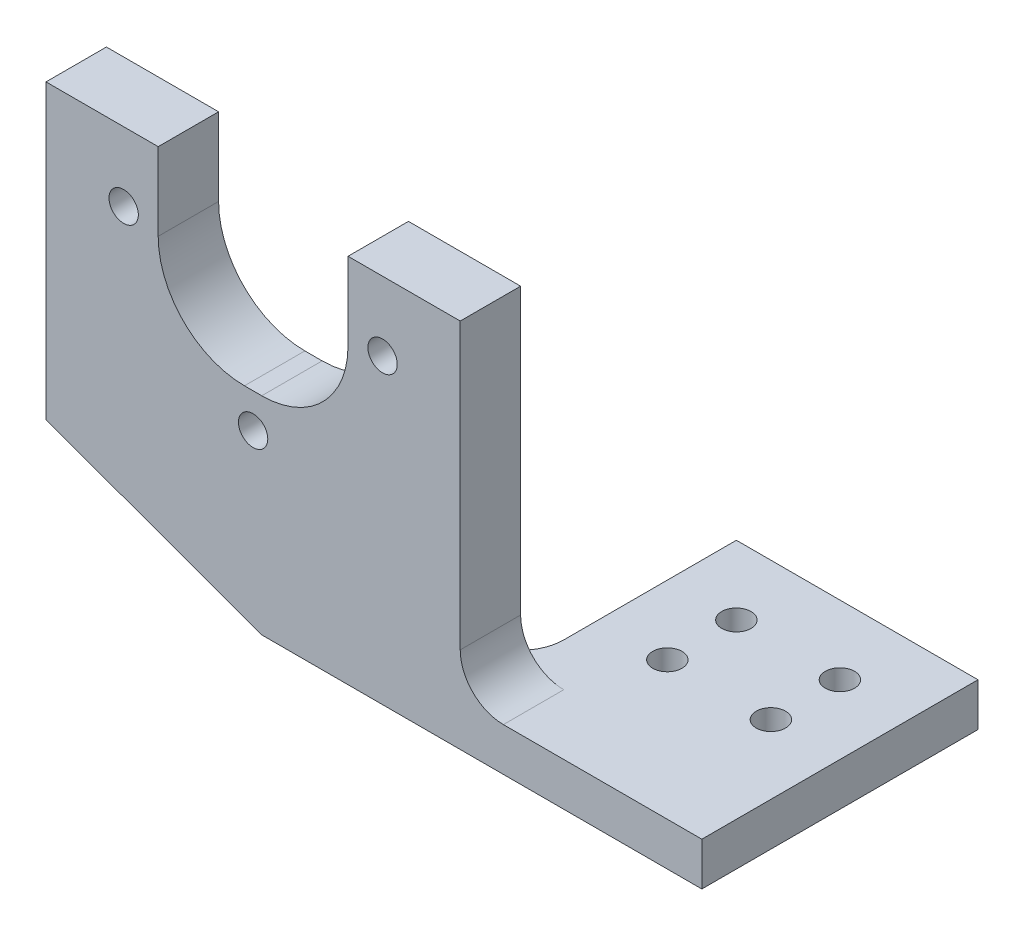
ISO-10303-21;
HEADER;
FILE_DESCRIPTION(('STEP AP214'),'2;1');
FILE_NAME('part.step','',(''),(''),'','','');
FILE_SCHEMA(('AUTOMOTIVE_DESIGN { 1 0 10303 214 1 1 1 1 }'));
ENDSEC;
DATA;
#1=APPLICATION_CONTEXT('core data for automotive mechanical design processes');
#2=APPLICATION_PROTOCOL_DEFINITION('international standard','automotive_design',2000,#1);
#3=PRODUCT_CONTEXT('',#1,'mechanical');
#4=PRODUCT('Part','Part','',(#3));
#5=PRODUCT_RELATED_PRODUCT_CATEGORY('part','',(#4));
#6=PRODUCT_DEFINITION_FORMATION('','',#4);
#7=PRODUCT_DEFINITION_CONTEXT('part definition',#1,'design');
#8=PRODUCT_DEFINITION('design','',#6,#7);
#9=PRODUCT_DEFINITION_SHAPE('','',#8);
#10=(LENGTH_UNIT() NAMED_UNIT(*) SI_UNIT(.MILLI.,.METRE.));
#11=(NAMED_UNIT(*) PLANE_ANGLE_UNIT() SI_UNIT($,.RADIAN.));
#12=(NAMED_UNIT(*) SI_UNIT($,.STERADIAN.) SOLID_ANGLE_UNIT());
#13=UNCERTAINTY_MEASURE_WITH_UNIT(LENGTH_MEASURE(1.E-05),#10,'distance_accuracy_value','');
#14=(GEOMETRIC_REPRESENTATION_CONTEXT(3) GLOBAL_UNCERTAINTY_ASSIGNED_CONTEXT((#13)) GLOBAL_UNIT_ASSIGNED_CONTEXT((#10,
#11,#12)) REPRESENTATION_CONTEXT('',''));
#15=CARTESIAN_POINT('',(0.,0.,0.));
#16=DIRECTION('',(0.,0.,1.));
#17=DIRECTION('',(1.,0.,0.));
#18=AXIS2_PLACEMENT_3D('',#15,#16,#17);
#19=CARTESIAN_POINT('',(14.,5.,16.));
#20=DIRECTION('',(-1.,0.,0.));
#21=DIRECTION('',(0.,0.,1.));
#22=AXIS2_PLACEMENT_3D('',#19,#20,#21);
#23=PLANE('',#22);
#24=DIRECTION('',(0.,0.,-1.));
#25=VECTOR('',#24,1.);
#26=CARTESIAN_POINT('',(14.,0.,16.));
#27=LINE('',#26,#25);
#28=CARTESIAN_POINT('',(14.,0.,16.));
#29=VERTEX_POINT('',#28);
#30=CARTESIAN_POINT('',(14.,0.,-16.));
#31=VERTEX_POINT('',#30);
#32=EDGE_CURVE('E241',#29,#31,#27,.T.);
#33=ORIENTED_EDGE('',*,*,#32,.T.);
#34=DIRECTION('',(0.,-1.,0.));
#35=VECTOR('',#34,1.);
#36=CARTESIAN_POINT('',(14.,5.,-16.));
#37=LINE('',#36,#35);
#38=CARTESIAN_POINT('',(14.,5.,-16.));
#39=VERTEX_POINT('',#38);
#40=EDGE_CURVE('E267',#39,#31,#37,.T.);
#41=ORIENTED_EDGE('',*,*,#40,.F.);
#42=DIRECTION('',(0.,0.,-1.));
#43=VECTOR('',#42,1.);
#44=CARTESIAN_POINT('',(14.,5.,16.));
#45=LINE('',#44,#43);
#46=CARTESIAN_POINT('',(14.,5.,16.));
#47=VERTEX_POINT('',#46);
#48=EDGE_CURVE('E242',#47,#39,#45,.T.);
#49=ORIENTED_EDGE('',*,*,#48,.F.);
#50=DIRECTION('',(0.,-1.,0.));
#51=VECTOR('',#50,1.);
#52=CARTESIAN_POINT('',(14.,5.,16.));
#53=LINE('',#52,#51);
#54=EDGE_CURVE('E253',#47,#29,#53,.T.);
#55=ORIENTED_EDGE('',*,*,#54,.T.);
#56=EDGE_LOOP('',(#33,#41,#49,#55));
#57=FACE_BOUND('',#56,.T.);
#58=ADVANCED_FACE('F36',(#57),#23,.F.);
#59=CARTESIAN_POINT('',(-14.,5.,-16.));
#60=DIRECTION('',(0.,0.,1.));
#61=DIRECTION('',(1.,0.,0.));
#62=AXIS2_PLACEMENT_3D('',#59,#60,#61);
#63=PLANE('',#62);
#64=DIRECTION('',(-1.,0.,0.));
#65=VECTOR('',#64,1.);
#66=CARTESIAN_POINT('',(-14.,0.,-16.));
#67=LINE('',#66,#65);
#68=CARTESIAN_POINT('',(-14.,0.,-16.));
#69=VERTEX_POINT('',#68);
#70=EDGE_CURVE('E256',#31,#69,#67,.T.);
#71=ORIENTED_EDGE('',*,*,#70,.T.);
#72=DIRECTION('',(0.,-1.,0.));
#73=VECTOR('',#72,1.);
#74=CARTESIAN_POINT('',(-14.,5.,-16.));
#75=LINE('',#74,#73);
#76=CARTESIAN_POINT('',(-14.,5.,-16.));
#77=VERTEX_POINT('',#76);
#78=EDGE_CURVE('E264',#77,#69,#75,.T.);
#79=ORIENTED_EDGE('',*,*,#78,.F.);
#80=DIRECTION('',(-1.,0.,0.));
#81=VECTOR('',#80,1.);
#82=CARTESIAN_POINT('',(-14.,5.,-16.));
#83=LINE('',#82,#81);
#84=EDGE_CURVE('E245',#39,#77,#83,.T.);
#85=ORIENTED_EDGE('',*,*,#84,.F.);
#86=ORIENTED_EDGE('',*,*,#40,.T.);
#87=EDGE_LOOP('',(#71,#79,#85,#86));
#88=FACE_BOUND('',#87,.T.);
#89=ADVANCED_FACE('F345',(#88),#63,.F.);
#90=CARTESIAN_POINT('',(-14.,5.,16.));
#91=DIRECTION('',(1.,0.,0.));
#92=DIRECTION('',(0.,0.,-1.));
#93=AXIS2_PLACEMENT_3D('',#90,#91,#92);
#94=PLANE('',#93);
#95=DIRECTION('',(0.,0.,1.));
#96=VECTOR('',#95,1.);
#97=CARTESIAN_POINT('',(-14.,0.,16.));
#98=LINE('',#97,#96);
#99=CARTESIAN_POINT('',(-14.,0.,4.));
#100=VERTEX_POINT('',#99);
#101=EDGE_CURVE('E258',#69,#100,#98,.T.);
#102=ORIENTED_EDGE('',*,*,#101,.T.);
#103=DIRECTION('',(0.,1.,0.));
#104=VECTOR('',#103,1.);
#105=CARTESIAN_POINT('',(-14.,5.,4.));
#106=LINE('',#105,#104);
#107=CARTESIAN_POINT('',(-14.,5.,4.));
#108=VERTEX_POINT('',#107);
#109=EDGE_CURVE('E299',#100,#108,#106,.T.);
#110=ORIENTED_EDGE('',*,*,#109,.T.);
#111=DIRECTION('',(0.,0.,1.));
#112=VECTOR('',#111,1.);
#113=CARTESIAN_POINT('',(-14.,5.,16.));
#114=LINE('',#113,#112);
#115=EDGE_CURVE('E248',#77,#108,#114,.T.);
#116=ORIENTED_EDGE('',*,*,#115,.F.);
#117=ORIENTED_EDGE('',*,*,#78,.T.);
#118=EDGE_LOOP('',(#102,#110,#116,#117));
#119=FACE_BOUND('',#118,.T.);
#120=ADVANCED_FACE('F351',(#119),#94,.F.);
#121=CARTESIAN_POINT('',(-14.,5.,16.));
#122=DIRECTION('',(0.,0.,-1.));
#123=DIRECTION('',(-1.,0.,0.));
#124=AXIS2_PLACEMENT_3D('',#121,#122,#123);
#125=PLANE('',#124);
#126=CARTESIAN_POINT('',(-53.,35.,16.));
#127=DIRECTION('',(0.,0.,1.));
#128=DIRECTION('',(1.,0.,0.));
#129=AXIS2_PLACEMENT_3D('',#126,#127,#128);
#130=CIRCLE('',#129,1.7);
#131=CARTESIAN_POINT('',(-51.3,35.,16.));
#132=VERTEX_POINT('',#131);
#133=EDGE_CURVE('E318',#132,#132,#130,.T.);
#134=ORIENTED_EDGE('',*,*,#133,.F.);
#135=EDGE_LOOP('',(#134));
#136=FACE_BOUND('',#135,.T.);
#137=CARTESIAN_POINT('',(-23.,35.,16.));
#138=DIRECTION('',(0.,0.,1.));
#139=DIRECTION('',(1.,0.,0.));
#140=AXIS2_PLACEMENT_3D('',#137,#138,#139);
#141=CIRCLE('',#140,1.7);
#142=CARTESIAN_POINT('',(-21.3,35.,16.));
#143=VERTEX_POINT('',#142);
#144=EDGE_CURVE('E317',#143,#143,#141,.T.);
#145=ORIENTED_EDGE('',*,*,#144,.F.);
#146=EDGE_LOOP('',(#145));
#147=FACE_BOUND('',#146,.T.);
#148=CARTESIAN_POINT('',(-38.,20.,16.));
#149=DIRECTION('',(0.,0.,1.));
#150=DIRECTION('',(1.,0.,0.));
#151=AXIS2_PLACEMENT_3D('',#148,#149,#150);
#152=CIRCLE('',#151,1.7);
#153=CARTESIAN_POINT('',(-36.3,20.,16.));
#154=VERTEX_POINT('',#153);
#155=EDGE_CURVE('E313',#154,#154,#152,.T.);
#156=ORIENTED_EDGE('',*,*,#155,.F.);
#157=EDGE_LOOP('',(#156));
#158=FACE_BOUND('',#157,.T.);
#159=DIRECTION('',(0.,-1.,0.));
#160=VECTOR('',#159,1.);
#161=CARTESIAN_POINT('',(-62.,0.,16.));
#162=LINE('',#161,#160);
#163=CARTESIAN_POINT('',(-62.,43.,16.));
#164=VERTEX_POINT('',#163);
#165=CARTESIAN_POINT('',(-62.,9.09925585665506,16.));
#166=VERTEX_POINT('',#165);
#167=EDGE_CURVE('E165',#164,#166,#162,.T.);
#168=ORIENTED_EDGE('',*,*,#167,.T.);
#169=DIRECTION('',(-0.93969262078591,0.342020143325666,0.));
#170=VECTOR('',#169,1.);
#171=CARTESIAN_POINT('',(-62.,9.09925585665506,16.));
#172=LINE('',#171,#170);
#173=CARTESIAN_POINT('',(-36.9999999999998,0.,16.));
#174=VERTEX_POINT('',#173);
#175=EDGE_CURVE('E58',#166,#174,#172,.F.);
#176=ORIENTED_EDGE('',*,*,#175,.T.);
#177=DIRECTION('',(1.,0.,0.));
#178=VECTOR('',#177,1.);
#179=CARTESIAN_POINT('',(-14.,0.,16.));
#180=LINE('',#179,#178);
#181=EDGE_CURVE('E246',#174,#29,#180,.T.);
#182=ORIENTED_EDGE('',*,*,#181,.T.);
#183=ORIENTED_EDGE('',*,*,#54,.F.);
#184=DIRECTION('',(1.,0.,0.));
#185=VECTOR('',#184,1.);
#186=CARTESIAN_POINT('',(-14.,5.,16.));
#187=LINE('',#186,#185);
#188=CARTESIAN_POINT('',(-9.,5.,16.));
#189=VERTEX_POINT('',#188);
#190=EDGE_CURVE('E251',#189,#47,#187,.T.);
#191=ORIENTED_EDGE('',*,*,#190,.F.);
#192=CARTESIAN_POINT('',(-9.,10.,16.));
#193=DIRECTION('',(0.,0.,-1.));
#194=DIRECTION('',(-1.,0.,0.));
#195=AXIS2_PLACEMENT_3D('',#192,#193,#194);
#196=CIRCLE('',#195,5.);
#197=CARTESIAN_POINT('',(-14.,10.,16.));
#198=VERTEX_POINT('',#197);
#199=EDGE_CURVE('E295',#189,#198,#196,.T.);
#200=ORIENTED_EDGE('',*,*,#199,.T.);
#201=DIRECTION('',(0.,1.,0.));
#202=VECTOR('',#201,1.);
#203=CARTESIAN_POINT('',(-14.,43.,16.));
#204=LINE('',#203,#202);
#205=CARTESIAN_POINT('',(-14.,43.,16.));
#206=VERTEX_POINT('',#205);
#207=EDGE_CURVE('E195',#198,#206,#204,.T.);
#208=ORIENTED_EDGE('',*,*,#207,.T.);
#209=DIRECTION('',(-1.,0.,0.));
#210=VECTOR('',#209,1.);
#211=CARTESIAN_POINT('',(-27.,43.,16.));
#212=LINE('',#211,#210);
#213=CARTESIAN_POINT('',(-27.,43.,16.));
#214=VERTEX_POINT('',#213);
#215=EDGE_CURVE('E171',#206,#214,#212,.T.);
#216=ORIENTED_EDGE('',*,*,#215,.T.);
#217=DIRECTION('',(0.,-1.,0.));
#218=VECTOR('',#217,1.);
#219=CARTESIAN_POINT('',(-27.,24.,16.));
#220=LINE('',#219,#218);
#221=CARTESIAN_POINT('',(-27.,34.,16.));
#222=VERTEX_POINT('',#221);
#223=EDGE_CURVE('E199',#214,#222,#220,.T.);
#224=ORIENTED_EDGE('',*,*,#223,.T.);
#225=CARTESIAN_POINT('',(-37.,34.,16.));
#226=DIRECTION('',(0.,0.,-1.));
#227=DIRECTION('',(-1.,0.,0.));
#228=AXIS2_PLACEMENT_3D('',#225,#226,#227);
#229=CIRCLE('',#228,10.);
#230=CARTESIAN_POINT('',(-37.,24.,16.));
#231=VERTEX_POINT('',#230);
#232=EDGE_CURVE('E280',#222,#231,#229,.T.);
#233=ORIENTED_EDGE('',*,*,#232,.T.);
#234=DIRECTION('',(-1.,0.,0.));
#235=VECTOR('',#234,1.);
#236=CARTESIAN_POINT('',(-49.,24.,16.));
#237=LINE('',#236,#235);
#238=CARTESIAN_POINT('',(-39.,24.,16.));
#239=VERTEX_POINT('',#238);
#240=EDGE_CURVE('E202',#231,#239,#237,.T.);
#241=ORIENTED_EDGE('',*,*,#240,.T.);
#242=CARTESIAN_POINT('',(-39.,34.,16.));
#243=DIRECTION('',(0.,0.,-1.));
#244=DIRECTION('',(-1.,0.,0.));
#245=AXIS2_PLACEMENT_3D('',#242,#243,#244);
#246=CIRCLE('',#245,10.);
#247=CARTESIAN_POINT('',(-49.,34.,16.));
#248=VERTEX_POINT('',#247);
#249=EDGE_CURVE('E284',#239,#248,#246,.T.);
#250=ORIENTED_EDGE('',*,*,#249,.T.);
#251=DIRECTION('',(0.,1.,0.));
#252=VECTOR('',#251,1.);
#253=CARTESIAN_POINT('',(-49.,43.,16.));
#254=LINE('',#253,#252);
#255=CARTESIAN_POINT('',(-49.,43.,16.));
#256=VERTEX_POINT('',#255);
#257=EDGE_CURVE('E205',#248,#256,#254,.T.);
#258=ORIENTED_EDGE('',*,*,#257,.T.);
#259=DIRECTION('',(-1.,0.,0.));
#260=VECTOR('',#259,1.);
#261=CARTESIAN_POINT('',(-62.,43.,16.));
#262=LINE('',#261,#260);
#263=EDGE_CURVE('E207',#256,#164,#262,.T.);
#264=ORIENTED_EDGE('',*,*,#263,.T.);
#265=EDGE_LOOP('',(#168,#176,#182,#183,#191,#200,#208,#216,#224,#233,#241,#250,#258,#264));
#266=FACE_BOUND('',#265,.T.);
#267=ADVANCED_FACE('F328',(#136,#147,#158,#266),#125,.F.);
#268=CARTESIAN_POINT('',(0.,5.,0.));
#269=DIRECTION('',(0.,-1.,0.));
#270=DIRECTION('',(0.,0.,-1.));
#271=AXIS2_PLACEMENT_3D('',#268,#269,#270);
#272=PLANE('',#271);
#273=CARTESIAN_POINT('',(-6.,5.,-8.));
#274=DIRECTION('',(0.,1.,0.));
#275=DIRECTION('',(0.,0.,1.));
#276=AXIS2_PLACEMENT_3D('',#273,#274,#275);
#277=CIRCLE('',#276,1.69999999999999);
#278=CARTESIAN_POINT('',(-6.,5.,-6.30000000000001));
#279=VERTEX_POINT('',#278);
#280=EDGE_CURVE('E213',#279,#279,#277,.T.);
#281=ORIENTED_EDGE('',*,*,#280,.F.);
#282=EDGE_LOOP('',(#281));
#283=FACE_BOUND('',#282,.T.);
#284=CARTESIAN_POINT('',(6.,5.,-8.));
#285=DIRECTION('',(0.,1.,0.));
#286=DIRECTION('',(0.,0.,1.));
#287=AXIS2_PLACEMENT_3D('',#284,#285,#286);
#288=CIRCLE('',#287,1.69999999999999);
#289=CARTESIAN_POINT('',(6.,5.,-6.30000000000001));
#290=VERTEX_POINT('',#289);
#291=EDGE_CURVE('E223',#290,#290,#288,.T.);
#292=ORIENTED_EDGE('',*,*,#291,.F.);
#293=EDGE_LOOP('',(#292));
#294=FACE_BOUND('',#293,.T.);
#295=CARTESIAN_POINT('',(6.,5.,0.));
#296=DIRECTION('',(0.,1.,0.));
#297=DIRECTION('',(0.,0.,1.));
#298=AXIS2_PLACEMENT_3D('',#295,#296,#297);
#299=CIRCLE('',#298,1.69999999999999);
#300=CARTESIAN_POINT('',(6.,5.,1.69999999999999));
#301=VERTEX_POINT('',#300);
#302=EDGE_CURVE('E229',#301,#301,#299,.T.);
#303=ORIENTED_EDGE('',*,*,#302,.F.);
#304=EDGE_LOOP('',(#303));
#305=FACE_BOUND('',#304,.T.);
#306=CARTESIAN_POINT('',(-6.,5.,0.));
#307=DIRECTION('',(0.,1.,0.));
#308=DIRECTION('',(0.,0.,1.));
#309=AXIS2_PLACEMENT_3D('',#306,#307,#308);
#310=CIRCLE('',#309,1.69999999999999);
#311=CARTESIAN_POINT('',(-6.,5.,1.69999999999999));
#312=VERTEX_POINT('',#311);
#313=EDGE_CURVE('E235',#312,#312,#310,.T.);
#314=ORIENTED_EDGE('',*,*,#313,.F.);
#315=EDGE_LOOP('',(#314));
#316=FACE_BOUND('',#315,.T.);
#317=DIRECTION('',(1.,0.,0.));
#318=VECTOR('',#317,1.);
#319=CARTESIAN_POINT('',(0.,5.,9.));
#320=LINE('',#319,#318);
#321=CARTESIAN_POINT('',(-19.,5.,9.));
#322=VERTEX_POINT('',#321);
#323=CARTESIAN_POINT('',(-9.,5.,9.));
#324=VERTEX_POINT('',#323);
#325=EDGE_CURVE('E288',#322,#324,#320,.T.);
#326=ORIENTED_EDGE('',*,*,#325,.T.);
#327=DIRECTION('',(0.,0.,1.));
#328=VECTOR('',#327,1.);
#329=CARTESIAN_POINT('',(-9.,5.,0.));
#330=LINE('',#329,#328);
#331=EDGE_CURVE('E291',#324,#189,#330,.T.);
#332=ORIENTED_EDGE('',*,*,#331,.T.);
#333=ORIENTED_EDGE('',*,*,#190,.T.);
#334=ORIENTED_EDGE('',*,*,#48,.T.);
#335=ORIENTED_EDGE('',*,*,#84,.T.);
#336=ORIENTED_EDGE('',*,*,#115,.T.);
#337=CARTESIAN_POINT('',(-19.,5.,4.));
#338=DIRECTION('',(0.,-1.,0.));
#339=DIRECTION('',(0.,0.,-1.));
#340=AXIS2_PLACEMENT_3D('',#337,#338,#339);
#341=CIRCLE('',#340,5.);
#342=EDGE_CURVE('E305',#108,#322,#341,.T.);
#343=ORIENTED_EDGE('',*,*,#342,.T.);
#344=EDGE_LOOP('',(#326,#332,#333,#334,#335,#336,#343));
#345=FACE_BOUND('',#344,.T.);
#346=ADVANCED_FACE('F390',(#283,#294,#305,#316,#345),#272,.F.);
#347=CARTESIAN_POINT('',(0.,0.,0.));
#348=DIRECTION('',(0.,-1.,0.));
#349=DIRECTION('',(0.,0.,-1.));
#350=AXIS2_PLACEMENT_3D('',#347,#348,#349);
#351=PLANE('',#350);
#352=CARTESIAN_POINT('',(-6.,0.,-8.));
#353=DIRECTION('',(0.,1.,0.));
#354=DIRECTION('',(0.,0.,1.));
#355=AXIS2_PLACEMENT_3D('',#352,#353,#354);
#356=CIRCLE('',#355,1.7);
#357=CARTESIAN_POINT('',(-6.,0.,-6.3));
#358=VERTEX_POINT('',#357);
#359=EDGE_CURVE('E220',#358,#358,#356,.T.);
#360=ORIENTED_EDGE('',*,*,#359,.T.);
#361=EDGE_LOOP('',(#360));
#362=FACE_BOUND('',#361,.T.);
#363=CARTESIAN_POINT('',(6.,0.,-8.));
#364=DIRECTION('',(0.,1.,0.));
#365=DIRECTION('',(0.,0.,1.));
#366=AXIS2_PLACEMENT_3D('',#363,#364,#365);
#367=CIRCLE('',#366,1.7);
#368=CARTESIAN_POINT('',(6.,0.,-6.3));
#369=VERTEX_POINT('',#368);
#370=EDGE_CURVE('E226',#369,#369,#367,.T.);
#371=ORIENTED_EDGE('',*,*,#370,.T.);
#372=EDGE_LOOP('',(#371));
#373=FACE_BOUND('',#372,.T.);
#374=CARTESIAN_POINT('',(6.,0.,0.));
#375=DIRECTION('',(0.,1.,0.));
#376=DIRECTION('',(0.,0.,1.));
#377=AXIS2_PLACEMENT_3D('',#374,#375,#376);
#378=CIRCLE('',#377,1.7);
#379=CARTESIAN_POINT('',(6.,0.,1.7));
#380=VERTEX_POINT('',#379);
#381=EDGE_CURVE('E232',#380,#380,#378,.T.);
#382=ORIENTED_EDGE('',*,*,#381,.T.);
#383=EDGE_LOOP('',(#382));
#384=FACE_BOUND('',#383,.T.);
#385=CARTESIAN_POINT('',(-6.,0.,0.));
#386=DIRECTION('',(0.,1.,0.));
#387=DIRECTION('',(0.,0.,1.));
#388=AXIS2_PLACEMENT_3D('',#385,#386,#387);
#389=CIRCLE('',#388,1.7);
#390=CARTESIAN_POINT('',(-6.,0.,1.7));
#391=VERTEX_POINT('',#390);
#392=EDGE_CURVE('E238',#391,#391,#389,.T.);
#393=ORIENTED_EDGE('',*,*,#392,.T.);
#394=EDGE_LOOP('',(#393));
#395=FACE_BOUND('',#394,.T.);
#396=ORIENTED_EDGE('',*,*,#181,.F.);
#397=DIRECTION('',(0.,0.,-1.));
#398=VECTOR('',#397,1.);
#399=CARTESIAN_POINT('',(-36.9999999999998,0.,0.));
#400=LINE('',#399,#398);
#401=CARTESIAN_POINT('',(-36.9999999999998,0.,9.));
#402=VERTEX_POINT('',#401);
#403=EDGE_CURVE('E44',#174,#402,#400,.T.);
#404=ORIENTED_EDGE('',*,*,#403,.T.);
#405=DIRECTION('',(1.,0.,0.));
#406=VECTOR('',#405,1.);
#407=CARTESIAN_POINT('',(-14.,0.,9.));
#408=LINE('',#407,#406);
#409=CARTESIAN_POINT('',(-19.,0.,9.));
#410=VERTEX_POINT('',#409);
#411=EDGE_CURVE('E173',#402,#410,#408,.T.);
#412=ORIENTED_EDGE('',*,*,#411,.T.);
#413=CARTESIAN_POINT('',(-19.,0.,4.));
#414=DIRECTION('',(0.,-1.,0.));
#415=DIRECTION('',(0.,0.,-1.));
#416=AXIS2_PLACEMENT_3D('',#413,#414,#415);
#417=CIRCLE('',#416,5.);
#418=EDGE_CURVE('E308',#410,#100,#417,.F.);
#419=ORIENTED_EDGE('',*,*,#418,.T.);
#420=ORIENTED_EDGE('',*,*,#101,.F.);
#421=ORIENTED_EDGE('',*,*,#70,.F.);
#422=ORIENTED_EDGE('',*,*,#32,.F.);
#423=EDGE_LOOP('',(#396,#404,#412,#419,#420,#421,#422));
#424=FACE_BOUND('',#423,.T.);
#425=ADVANCED_FACE('F380',(#362,#373,#384,#395,#424),#351,.T.);
#426=CARTESIAN_POINT('',(-6.,5.,0.));
#427=DIRECTION('',(0.,1.,0.));
#428=DIRECTION('',(0.,0.,1.));
#429=AXIS2_PLACEMENT_3D('',#426,#427,#428);
#430=CYLINDRICAL_SURFACE('',#429,1.69999999999999);
#431=ORIENTED_EDGE('',*,*,#392,.F.);
#432=EDGE_LOOP('',(#431));
#433=FACE_BOUND('',#432,.T.);
#434=ORIENTED_EDGE('',*,*,#313,.T.);
#435=EDGE_LOOP('',(#434));
#436=FACE_BOUND('',#435,.T.);
#437=ADVANCED_FACE('F399',(#433,#436),#430,.F.);
#438=CARTESIAN_POINT('',(6.,5.,0.));
#439=DIRECTION('',(0.,1.,0.));
#440=DIRECTION('',(0.,0.,1.));
#441=AXIS2_PLACEMENT_3D('',#438,#439,#440);
#442=CYLINDRICAL_SURFACE('',#441,1.69999999999999);
#443=ORIENTED_EDGE('',*,*,#381,.F.);
#444=EDGE_LOOP('',(#443));
#445=FACE_BOUND('',#444,.T.);
#446=ORIENTED_EDGE('',*,*,#302,.T.);
#447=EDGE_LOOP('',(#446));
#448=FACE_BOUND('',#447,.T.);
#449=ADVANCED_FACE('F554',(#445,#448),#442,.F.);
#450=CARTESIAN_POINT('',(6.,5.,-8.));
#451=DIRECTION('',(0.,1.,0.));
#452=DIRECTION('',(0.,0.,1.));
#453=AXIS2_PLACEMENT_3D('',#450,#451,#452);
#454=CYLINDRICAL_SURFACE('',#453,1.69999999999999);
#455=ORIENTED_EDGE('',*,*,#370,.F.);
#456=EDGE_LOOP('',(#455));
#457=FACE_BOUND('',#456,.T.);
#458=ORIENTED_EDGE('',*,*,#291,.T.);
#459=EDGE_LOOP('',(#458));
#460=FACE_BOUND('',#459,.T.);
#461=ADVANCED_FACE('F544',(#457,#460),#454,.F.);
#462=CARTESIAN_POINT('',(-6.,5.,-8.));
#463=DIRECTION('',(0.,1.,0.));
#464=DIRECTION('',(0.,0.,1.));
#465=AXIS2_PLACEMENT_3D('',#462,#463,#464);
#466=CYLINDRICAL_SURFACE('',#465,1.69999999999999);
#467=ORIENTED_EDGE('',*,*,#359,.F.);
#468=EDGE_LOOP('',(#467));
#469=FACE_BOUND('',#468,.T.);
#470=ORIENTED_EDGE('',*,*,#280,.T.);
#471=EDGE_LOOP('',(#470));
#472=FACE_BOUND('',#471,.T.);
#473=ADVANCED_FACE('F540',(#469,#472),#466,.F.);
#474=CARTESIAN_POINT('',(-14.,43.,9.));
#475=DIRECTION('',(1.,0.,0.));
#476=DIRECTION('',(0.,1.,0.));
#477=AXIS2_PLACEMENT_3D('',#474,#475,#476);
#478=PLANE('',#477);
#479=ORIENTED_EDGE('',*,*,#207,.F.);
#480=DIRECTION('',(0.,0.,1.));
#481=VECTOR('',#480,1.);
#482=CARTESIAN_POINT('',(-14.,10.,9.));
#483=LINE('',#482,#481);
#484=CARTESIAN_POINT('',(-14.,10.,9.));
#485=VERTEX_POINT('',#484);
#486=EDGE_CURVE('E160',#198,#485,#483,.F.);
#487=ORIENTED_EDGE('',*,*,#486,.T.);
#488=DIRECTION('',(0.,1.,0.));
#489=VECTOR('',#488,1.);
#490=CARTESIAN_POINT('',(-14.,43.,9.));
#491=LINE('',#490,#489);
#492=CARTESIAN_POINT('',(-14.,43.,9.));
#493=VERTEX_POINT('',#492);
#494=EDGE_CURVE('E153',#485,#493,#491,.T.);
#495=ORIENTED_EDGE('',*,*,#494,.T.);
#496=DIRECTION('',(0.,0.,1.));
#497=VECTOR('',#496,1.);
#498=CARTESIAN_POINT('',(-14.,43.,9.));
#499=LINE('',#498,#497);
#500=EDGE_CURVE('E157',#493,#206,#499,.T.);
#501=ORIENTED_EDGE('',*,*,#500,.T.);
#502=EDGE_LOOP('',(#479,#487,#495,#501));
#503=FACE_BOUND('',#502,.T.);
#504=ADVANCED_FACE('F156',(#503),#478,.T.);
#505=CARTESIAN_POINT('',(-62.,0.,9.));
#506=DIRECTION('',(-1.,0.,0.));
#507=DIRECTION('',(0.,-1.,0.));
#508=AXIS2_PLACEMENT_3D('',#505,#506,#507);
#509=PLANE('',#508);
#510=DIRECTION('',(0.,-1.,0.));
#511=VECTOR('',#510,1.);
#512=CARTESIAN_POINT('',(-62.,0.,9.));
#513=LINE('',#512,#511);
#514=CARTESIAN_POINT('',(-62.,43.,9.));
#515=VERTEX_POINT('',#514);
#516=CARTESIAN_POINT('',(-62.,9.09925585665506,9.));
#517=VERTEX_POINT('',#516);
#518=EDGE_CURVE('E191',#515,#517,#513,.T.);
#519=ORIENTED_EDGE('',*,*,#518,.T.);
#520=DIRECTION('',(0.,0.,1.));
#521=VECTOR('',#520,1.);
#522=CARTESIAN_POINT('',(-62.,9.09925585665506,9.));
#523=LINE('',#522,#521);
#524=EDGE_CURVE('E310',#517,#166,#523,.T.);
#525=ORIENTED_EDGE('',*,*,#524,.T.);
#526=ORIENTED_EDGE('',*,*,#167,.F.);
#527=DIRECTION('',(0.,0.,1.));
#528=VECTOR('',#527,1.);
#529=CARTESIAN_POINT('',(-62.,43.,9.));
#530=LINE('',#529,#528);
#531=EDGE_CURVE('E211',#515,#164,#530,.T.);
#532=ORIENTED_EDGE('',*,*,#531,.F.);
#533=EDGE_LOOP('',(#519,#525,#526,#532));
#534=FACE_BOUND('',#533,.T.);
#535=ADVANCED_FACE('F324',(#534),#509,.T.);
#536=CARTESIAN_POINT('',(-62.,43.,9.));
#537=DIRECTION('',(0.,1.,0.));
#538=DIRECTION('',(0.,0.,1.));
#539=AXIS2_PLACEMENT_3D('',#536,#537,#538);
#540=PLANE('',#539);
#541=ORIENTED_EDGE('',*,*,#263,.F.);
#542=DIRECTION('',(0.,0.,1.));
#543=VECTOR('',#542,1.);
#544=CARTESIAN_POINT('',(-49.,43.,9.));
#545=LINE('',#544,#543);
#546=CARTESIAN_POINT('',(-49.,43.,9.));
#547=VERTEX_POINT('',#546);
#548=EDGE_CURVE('E214',#547,#256,#545,.T.);
#549=ORIENTED_EDGE('',*,*,#548,.F.);
#550=DIRECTION('',(-1.,0.,0.));
#551=VECTOR('',#550,1.);
#552=CARTESIAN_POINT('',(-62.,43.,9.));
#553=LINE('',#552,#551);
#554=EDGE_CURVE('E188',#547,#515,#553,.T.);
#555=ORIENTED_EDGE('',*,*,#554,.T.);
#556=ORIENTED_EDGE('',*,*,#531,.T.);
#557=EDGE_LOOP('',(#541,#549,#555,#556));
#558=FACE_BOUND('',#557,.T.);
#559=ADVANCED_FACE('F333',(#558),#540,.T.);
#560=CARTESIAN_POINT('',(-49.,43.,9.));
#561=DIRECTION('',(1.,0.,0.));
#562=DIRECTION('',(0.,0.,-1.));
#563=AXIS2_PLACEMENT_3D('',#560,#561,#562);
#564=PLANE('',#563);
#565=ORIENTED_EDGE('',*,*,#257,.F.);
#566=DIRECTION('',(0.,0.,1.));
#567=VECTOR('',#566,1.);
#568=CARTESIAN_POINT('',(-49.,34.,9.));
#569=LINE('',#568,#567);
#570=CARTESIAN_POINT('',(-49.,34.,9.));
#571=VERTEX_POINT('',#570);
#572=EDGE_CURVE('E278',#248,#571,#569,.F.);
#573=ORIENTED_EDGE('',*,*,#572,.T.);
#574=DIRECTION('',(0.,1.,0.));
#575=VECTOR('',#574,1.);
#576=CARTESIAN_POINT('',(-49.,43.,9.));
#577=LINE('',#576,#575);
#578=EDGE_CURVE('E186',#571,#547,#577,.T.);
#579=ORIENTED_EDGE('',*,*,#578,.T.);
#580=ORIENTED_EDGE('',*,*,#548,.T.);
#581=EDGE_LOOP('',(#565,#573,#579,#580));
#582=FACE_BOUND('',#581,.T.);
#583=ADVANCED_FACE('F513',(#582),#564,.T.);
#584=CARTESIAN_POINT('',(-49.,24.,9.));
#585=DIRECTION('',(0.,1.,0.));
#586=DIRECTION('',(0.,0.,1.));
#587=AXIS2_PLACEMENT_3D('',#584,#585,#586);
#588=PLANE('',#587);
#589=ORIENTED_EDGE('',*,*,#240,.F.);
#590=DIRECTION('',(0.,0.,1.));
#591=VECTOR('',#590,1.);
#592=CARTESIAN_POINT('',(-37.,24.,9.));
#593=LINE('',#592,#591);
#594=CARTESIAN_POINT('',(-37.,24.,9.));
#595=VERTEX_POINT('',#594);
#596=EDGE_CURVE('E276',#231,#595,#593,.F.);
#597=ORIENTED_EDGE('',*,*,#596,.T.);
#598=DIRECTION('',(-1.,0.,0.));
#599=VECTOR('',#598,1.);
#600=CARTESIAN_POINT('',(-49.,24.,9.));
#601=LINE('',#600,#599);
#602=CARTESIAN_POINT('',(-39.,24.,9.));
#603=VERTEX_POINT('',#602);
#604=EDGE_CURVE('E180',#595,#603,#601,.T.);
#605=ORIENTED_EDGE('',*,*,#604,.T.);
#606=DIRECTION('',(0.,0.,1.));
#607=VECTOR('',#606,1.);
#608=CARTESIAN_POINT('',(-39.,24.,16.));
#609=LINE('',#608,#607);
#610=EDGE_CURVE('E273',#603,#239,#609,.T.);
#611=ORIENTED_EDGE('',*,*,#610,.T.);
#612=EDGE_LOOP('',(#589,#597,#605,#611));
#613=FACE_BOUND('',#612,.T.);
#614=ADVANCED_FACE('F503',(#613),#588,.T.);
#615=CARTESIAN_POINT('',(-27.,24.,9.));
#616=DIRECTION('',(-1.,0.,0.));
#617=DIRECTION('',(0.,0.,1.));
#618=AXIS2_PLACEMENT_3D('',#615,#616,#617);
#619=PLANE('',#618);
#620=DIRECTION('',(0.,-1.,0.));
#621=VECTOR('',#620,1.);
#622=CARTESIAN_POINT('',(-27.,24.,9.));
#623=LINE('',#622,#621);
#624=CARTESIAN_POINT('',(-27.,43.,9.));
#625=VERTEX_POINT('',#624);
#626=CARTESIAN_POINT('',(-27.,34.,9.));
#627=VERTEX_POINT('',#626);
#628=EDGE_CURVE('E178',#625,#627,#623,.T.);
#629=ORIENTED_EDGE('',*,*,#628,.T.);
#630=DIRECTION('',(0.,0.,1.));
#631=VECTOR('',#630,1.);
#632=CARTESIAN_POINT('',(-27.,34.,16.));
#633=LINE('',#632,#631);
#634=EDGE_CURVE('E270',#627,#222,#633,.T.);
#635=ORIENTED_EDGE('',*,*,#634,.T.);
#636=ORIENTED_EDGE('',*,*,#223,.F.);
#637=DIRECTION('',(0.,0.,1.));
#638=VECTOR('',#637,1.);
#639=CARTESIAN_POINT('',(-27.,43.,9.));
#640=LINE('',#639,#638);
#641=EDGE_CURVE('E172',#625,#214,#640,.T.);
#642=ORIENTED_EDGE('',*,*,#641,.F.);
#643=EDGE_LOOP('',(#629,#635,#636,#642));
#644=FACE_BOUND('',#643,.T.);
#645=ADVANCED_FACE('F498',(#644),#619,.T.);
#646=CARTESIAN_POINT('',(-27.,43.,9.));
#647=DIRECTION('',(0.,1.,0.));
#648=DIRECTION('',(-1.,0.,0.));
#649=AXIS2_PLACEMENT_3D('',#646,#647,#648);
#650=PLANE('',#649);
#651=ORIENTED_EDGE('',*,*,#215,.F.);
#652=ORIENTED_EDGE('',*,*,#500,.F.);
#653=DIRECTION('',(-1.,0.,0.));
#654=VECTOR('',#653,1.);
#655=CARTESIAN_POINT('',(-27.,43.,9.));
#656=LINE('',#655,#654);
#657=EDGE_CURVE('E164',#493,#625,#656,.T.);
#658=ORIENTED_EDGE('',*,*,#657,.T.);
#659=ORIENTED_EDGE('',*,*,#641,.T.);
#660=EDGE_LOOP('',(#651,#652,#658,#659));
#661=FACE_BOUND('',#660,.T.);
#662=ADVANCED_FACE('F169',(#661),#650,.T.);
#663=CARTESIAN_POINT('',(0.,0.,9.));
#664=DIRECTION('',(0.,0.,-1.));
#665=DIRECTION('',(-1.,0.,0.));
#666=AXIS2_PLACEMENT_3D('',#663,#664,#665);
#667=PLANE('',#666);
#668=CARTESIAN_POINT('',(-53.,35.,9.));
#669=DIRECTION('',(0.,0.,-1.));
#670=DIRECTION('',(-1.,0.,0.));
#671=AXIS2_PLACEMENT_3D('',#668,#669,#670);
#672=CIRCLE('',#671,1.7);
#673=CARTESIAN_POINT('',(-54.7,35.,9.));
#674=VERTEX_POINT('',#673);
#675=EDGE_CURVE('E314',#674,#674,#672,.T.);
#676=ORIENTED_EDGE('',*,*,#675,.F.);
#677=EDGE_LOOP('',(#676));
#678=FACE_BOUND('',#677,.T.);
#679=CARTESIAN_POINT('',(-23.,35.,9.));
#680=DIRECTION('',(0.,0.,-1.));
#681=DIRECTION('',(-1.,0.,0.));
#682=AXIS2_PLACEMENT_3D('',#679,#680,#681);
#683=CIRCLE('',#682,1.7);
#684=CARTESIAN_POINT('',(-24.7,35.,9.));
#685=VERTEX_POINT('',#684);
#686=EDGE_CURVE('E630',#685,#685,#683,.T.);
#687=ORIENTED_EDGE('',*,*,#686,.F.);
#688=EDGE_LOOP('',(#687));
#689=FACE_BOUND('',#688,.T.);
#690=CARTESIAN_POINT('',(-38.,20.,9.));
#691=DIRECTION('',(0.,0.,-1.));
#692=DIRECTION('',(-1.,0.,0.));
#693=AXIS2_PLACEMENT_3D('',#690,#691,#692);
#694=CIRCLE('',#693,1.7);
#695=CARTESIAN_POINT('',(-39.7,20.,9.));
#696=VERTEX_POINT('',#695);
#697=EDGE_CURVE('E197',#696,#696,#694,.T.);
#698=ORIENTED_EDGE('',*,*,#697,.F.);
#699=EDGE_LOOP('',(#698));
#700=FACE_BOUND('',#699,.T.);
#701=ORIENTED_EDGE('',*,*,#411,.F.);
#702=DIRECTION('',(0.93969262078591,-0.342020143325666,0.));
#703=VECTOR('',#702,1.);
#704=CARTESIAN_POINT('',(-4.32817780229881,-11.8915707792008,9.));
#705=LINE('',#704,#703);
#706=EDGE_CURVE('E11',#402,#517,#705,.F.);
#707=ORIENTED_EDGE('',*,*,#706,.T.);
#708=ORIENTED_EDGE('',*,*,#518,.F.);
#709=ORIENTED_EDGE('',*,*,#554,.F.);
#710=ORIENTED_EDGE('',*,*,#578,.F.);
#711=CARTESIAN_POINT('',(-39.,34.,9.));
#712=DIRECTION('',(0.,0.,-1.));
#713=DIRECTION('',(-1.,0.,0.));
#714=AXIS2_PLACEMENT_3D('',#711,#712,#713);
#715=CIRCLE('',#714,10.);
#716=EDGE_CURVE('E286',#571,#603,#715,.F.);
#717=ORIENTED_EDGE('',*,*,#716,.T.);
#718=ORIENTED_EDGE('',*,*,#604,.F.);
#719=CARTESIAN_POINT('',(-37.,34.,9.));
#720=DIRECTION('',(0.,0.,-1.));
#721=DIRECTION('',(-1.,0.,0.));
#722=AXIS2_PLACEMENT_3D('',#719,#720,#721);
#723=CIRCLE('',#722,10.);
#724=EDGE_CURVE('E282',#595,#627,#723,.F.);
#725=ORIENTED_EDGE('',*,*,#724,.T.);
#726=ORIENTED_EDGE('',*,*,#628,.F.);
#727=ORIENTED_EDGE('',*,*,#657,.F.);
#728=ORIENTED_EDGE('',*,*,#494,.F.);
#729=CARTESIAN_POINT('',(-9.,10.,9.));
#730=DIRECTION('',(0.,0.,-1.));
#731=DIRECTION('',(-1.,0.,0.));
#732=AXIS2_PLACEMENT_3D('',#729,#730,#731);
#733=CIRCLE('',#732,5.);
#734=EDGE_CURVE('E297',#485,#324,#733,.F.);
#735=ORIENTED_EDGE('',*,*,#734,.T.);
#736=ORIENTED_EDGE('',*,*,#325,.F.);
#737=DIRECTION('',(0.,1.,0.));
#738=VECTOR('',#737,1.);
#739=CARTESIAN_POINT('',(-19.,0.,9.));
#740=LINE('',#739,#738);
#741=EDGE_CURVE('E302',#322,#410,#740,.F.);
#742=ORIENTED_EDGE('',*,*,#741,.T.);
#743=EDGE_LOOP('',(#701,#707,#708,#709,#710,#717,#718,#725,#726,#727,#728,#735,#736,#742));
#744=FACE_BOUND('',#743,.T.);
#745=ADVANCED_FACE('F176',(#678,#689,#700,#744),#667,.T.);
#746=CARTESIAN_POINT('',(-37.,34.,9.));
#747=DIRECTION('',(0.,0.,-1.));
#748=DIRECTION('',(-1.,0.,0.));
#749=AXIS2_PLACEMENT_3D('',#746,#747,#748);
#750=CYLINDRICAL_SURFACE('',#749,10.);
#751=ORIENTED_EDGE('',*,*,#724,.F.);
#752=ORIENTED_EDGE('',*,*,#596,.F.);
#753=ORIENTED_EDGE('',*,*,#232,.F.);
#754=ORIENTED_EDGE('',*,*,#634,.F.);
#755=EDGE_LOOP('',(#751,#752,#753,#754));
#756=FACE_BOUND('',#755,.T.);
#757=ADVANCED_FACE('F356',(#756),#750,.F.);
#758=CARTESIAN_POINT('',(-39.,34.,9.));
#759=DIRECTION('',(0.,0.,-1.));
#760=DIRECTION('',(-1.,0.,0.));
#761=AXIS2_PLACEMENT_3D('',#758,#759,#760);
#762=CYLINDRICAL_SURFACE('',#761,10.);
#763=ORIENTED_EDGE('',*,*,#716,.F.);
#764=ORIENTED_EDGE('',*,*,#572,.F.);
#765=ORIENTED_EDGE('',*,*,#249,.F.);
#766=ORIENTED_EDGE('',*,*,#610,.F.);
#767=EDGE_LOOP('',(#763,#764,#765,#766));
#768=FACE_BOUND('',#767,.T.);
#769=ADVANCED_FACE('F359',(#768),#762,.F.);
#770=CARTESIAN_POINT('',(-9.,10.,0.));
#771=DIRECTION('',(0.,0.,1.));
#772=DIRECTION('',(1.,0.,0.));
#773=AXIS2_PLACEMENT_3D('',#770,#771,#772);
#774=CYLINDRICAL_SURFACE('',#773,5.);
#775=ORIENTED_EDGE('',*,*,#734,.F.);
#776=ORIENTED_EDGE('',*,*,#486,.F.);
#777=ORIENTED_EDGE('',*,*,#199,.F.);
#778=ORIENTED_EDGE('',*,*,#331,.F.);
#779=EDGE_LOOP('',(#775,#776,#777,#778));
#780=FACE_BOUND('',#779,.T.);
#781=ADVANCED_FACE('F363',(#780),#774,.F.);
#782=CARTESIAN_POINT('',(-19.,5.,4.));
#783=DIRECTION('',(0.,1.,0.));
#784=DIRECTION('',(0.,0.,1.));
#785=AXIS2_PLACEMENT_3D('',#782,#783,#784);
#786=CYLINDRICAL_SURFACE('',#785,5.);
#787=ORIENTED_EDGE('',*,*,#418,.F.);
#788=ORIENTED_EDGE('',*,*,#741,.F.);
#789=ORIENTED_EDGE('',*,*,#342,.F.);
#790=ORIENTED_EDGE('',*,*,#109,.F.);
#791=EDGE_LOOP('',(#787,#788,#789,#790));
#792=FACE_BOUND('',#791,.T.);
#793=ADVANCED_FACE('F366',(#792),#786,.F.);
#794=CARTESIAN_POINT('',(-38.,20.,16.));
#795=DIRECTION('',(0.,0.,1.));
#796=DIRECTION('',(1.,0.,0.));
#797=AXIS2_PLACEMENT_3D('',#794,#795,#796);
#798=CYLINDRICAL_SURFACE('',#797,1.7);
#799=ORIENTED_EDGE('',*,*,#697,.T.);
#800=EDGE_LOOP('',(#799));
#801=FACE_BOUND('',#800,.T.);
#802=ORIENTED_EDGE('',*,*,#155,.T.);
#803=EDGE_LOOP('',(#802));
#804=FACE_BOUND('',#803,.T.);
#805=ADVANCED_FACE('F369',(#801,#804),#798,.F.);
#806=CARTESIAN_POINT('',(-23.,35.,16.));
#807=DIRECTION('',(0.,0.,1.));
#808=DIRECTION('',(1.,0.,0.));
#809=AXIS2_PLACEMENT_3D('',#806,#807,#808);
#810=CYLINDRICAL_SURFACE('',#809,1.7);
#811=ORIENTED_EDGE('',*,*,#686,.T.);
#812=EDGE_LOOP('',(#811));
#813=FACE_BOUND('',#812,.T.);
#814=ORIENTED_EDGE('',*,*,#144,.T.);
#815=EDGE_LOOP('',(#814));
#816=FACE_BOUND('',#815,.T.);
#817=ADVANCED_FACE('F341',(#813,#816),#810,.F.);
#818=CARTESIAN_POINT('',(-53.,35.,16.));
#819=DIRECTION('',(0.,0.,1.));
#820=DIRECTION('',(1.,0.,0.));
#821=AXIS2_PLACEMENT_3D('',#818,#819,#820);
#822=CYLINDRICAL_SURFACE('',#821,1.7);
#823=ORIENTED_EDGE('',*,*,#675,.T.);
#824=EDGE_LOOP('',(#823));
#825=FACE_BOUND('',#824,.T.);
#826=ORIENTED_EDGE('',*,*,#133,.T.);
#827=EDGE_LOOP('',(#826));
#828=FACE_BOUND('',#827,.T.);
#829=ADVANCED_FACE('F337',(#825,#828),#822,.F.);
#830=CARTESIAN_POINT('',(-62.,9.09925585665506,9.));
#831=DIRECTION('',(0.342020143325666,0.939692620785909,0.));
#832=DIRECTION('',(0.,0.,1.));
#833=AXIS2_PLACEMENT_3D('',#830,#831,#832);
#834=PLANE('',#833);
#835=ORIENTED_EDGE('',*,*,#706,.F.);
#836=ORIENTED_EDGE('',*,*,#403,.F.);
#837=ORIENTED_EDGE('',*,*,#175,.F.);
#838=ORIENTED_EDGE('',*,*,#524,.F.);
#839=EDGE_LOOP('',(#835,#836,#837,#838));
#840=FACE_BOUND('',#839,.T.);
#841=ADVANCED_FACE('F38',(#840),#834,.F.);
#842=CLOSED_SHELL('',(#58,#89,#120,#267,#346,#425,#437,#449,#461,#473,#504,#535,#559,#583,#614,
#645,#662,#745,#757,#769,#781,#793,#805,#817,#829,#841));
#843=MANIFOLD_SOLID_BREP('B2',#842);
#844=ADVANCED_BREP_SHAPE_REPRESENTATION('',(#18,#843),#14);
#845=SHAPE_DEFINITION_REPRESENTATION(#9,#844);
ENDSEC;
END-ISO-10303-21;
